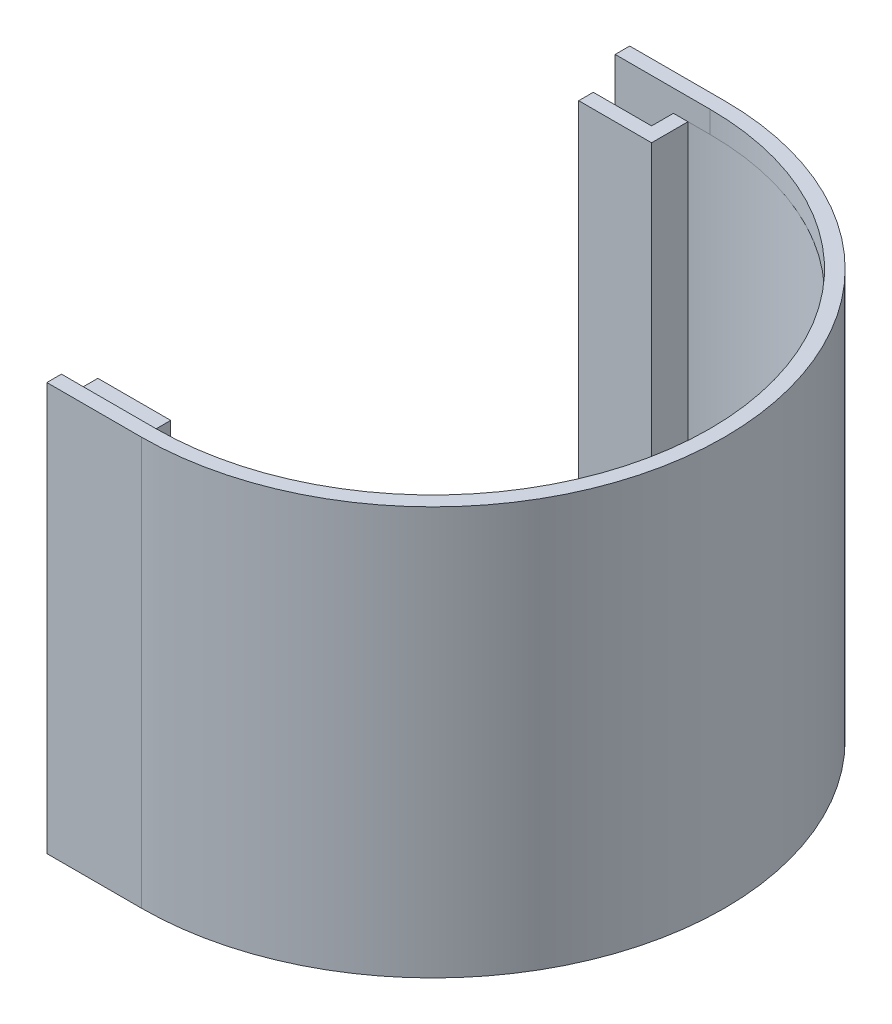
ISO-10303-21;
HEADER;
FILE_DESCRIPTION(('STEP AP214'),'2;1');
FILE_NAME('part.step','',(''),(''),'','','');
FILE_SCHEMA(('AUTOMOTIVE_DESIGN { 1 0 10303 214 1 1 1 1 }'));
ENDSEC;
DATA;
#1=APPLICATION_CONTEXT('core data for automotive mechanical design processes');
#2=APPLICATION_PROTOCOL_DEFINITION('international standard','automotive_design',2000,#1);
#3=PRODUCT_CONTEXT('',#1,'mechanical');
#4=PRODUCT('Part','Part','',(#3));
#5=PRODUCT_RELATED_PRODUCT_CATEGORY('part','',(#4));
#6=PRODUCT_DEFINITION_FORMATION('','',#4);
#7=PRODUCT_DEFINITION_CONTEXT('part definition',#1,'design');
#8=PRODUCT_DEFINITION('design','',#6,#7);
#9=PRODUCT_DEFINITION_SHAPE('','',#8);
#10=(LENGTH_UNIT() NAMED_UNIT(*) SI_UNIT(.MILLI.,.METRE.));
#11=(NAMED_UNIT(*) PLANE_ANGLE_UNIT() SI_UNIT($,.RADIAN.));
#12=(NAMED_UNIT(*) SI_UNIT($,.STERADIAN.) SOLID_ANGLE_UNIT());
#13=UNCERTAINTY_MEASURE_WITH_UNIT(LENGTH_MEASURE(1.E-05),#10,'distance_accuracy_value','');
#14=(GEOMETRIC_REPRESENTATION_CONTEXT(3) GLOBAL_UNCERTAINTY_ASSIGNED_CONTEXT((#13)) GLOBAL_UNIT_ASSIGNED_CONTEXT((#10,
#11,#12)) REPRESENTATION_CONTEXT('',''));
#15=CARTESIAN_POINT('',(0.,0.,0.));
#16=DIRECTION('',(0.,0.,1.));
#17=DIRECTION('',(1.,0.,0.));
#18=AXIS2_PLACEMENT_3D('',#15,#16,#17);
#19=CARTESIAN_POINT('',(0.,0.,0.));
#20=DIRECTION('',(0.,-1.,0.));
#21=DIRECTION('',(0.,0.,-1.));
#22=AXIS2_PLACEMENT_3D('',#19,#20,#21);
#23=PLANE('',#22);
#24=DIRECTION('',(-1.,0.,0.));
#25=VECTOR('',#24,1.);
#26=CARTESIAN_POINT('',(-13.,0.,-38.));
#27=LINE('',#26,#25);
#28=CARTESIAN_POINT('',(-3.,0.,-38.));
#29=VERTEX_POINT('',#28);
#30=CARTESIAN_POINT('',(-5.,0.,-38.));
#31=VERTEX_POINT('',#30);
#32=EDGE_CURVE('E13',#29,#31,#27,.T.);
#33=ORIENTED_EDGE('',*,*,#32,.F.);
#34=DIRECTION('',(0.,0.,-1.));
#35=VECTOR('',#34,1.);
#36=CARTESIAN_POINT('',(-3.,0.,-33.));
#37=LINE('',#36,#35);
#38=CARTESIAN_POINT('',(-3.,0.,-33.));
#39=VERTEX_POINT('',#38);
#40=EDGE_CURVE('E176',#39,#29,#37,.T.);
#41=ORIENTED_EDGE('',*,*,#40,.F.);
#42=DIRECTION('',(1.,0.,0.));
#43=VECTOR('',#42,1.);
#44=CARTESIAN_POINT('',(-13.,0.,-33.));
#45=LINE('',#44,#43);
#46=CARTESIAN_POINT('',(-13.,0.,-33.));
#47=VERTEX_POINT('',#46);
#48=EDGE_CURVE('E174',#47,#39,#45,.T.);
#49=ORIENTED_EDGE('',*,*,#48,.F.);
#50=DIRECTION('',(0.,0.,1.));
#51=VECTOR('',#50,1.);
#52=CARTESIAN_POINT('',(-13.,0.,-35.));
#53=LINE('',#52,#51);
#54=CARTESIAN_POINT('',(-13.,0.,-35.));
#55=VERTEX_POINT('',#54);
#56=EDGE_CURVE('E172',#55,#47,#53,.T.);
#57=ORIENTED_EDGE('',*,*,#56,.F.);
#58=DIRECTION('',(-1.,0.,0.));
#59=VECTOR('',#58,1.);
#60=CARTESIAN_POINT('',(-5.,0.,-35.));
#61=LINE('',#60,#59);
#62=CARTESIAN_POINT('',(-5.,0.,-35.));
#63=VERTEX_POINT('',#62);
#64=EDGE_CURVE('E169',#63,#55,#61,.T.);
#65=ORIENTED_EDGE('',*,*,#64,.F.);
#66=DIRECTION('',(0.,0.,1.));
#67=VECTOR('',#66,1.);
#68=CARTESIAN_POINT('',(-5.,0.,-38.));
#69=LINE('',#68,#67);
#70=EDGE_CURVE('E167',#31,#63,#69,.T.);
#71=ORIENTED_EDGE('',*,*,#70,.F.);
#72=EDGE_LOOP('',(#33,#41,#49,#57,#65,#71));
#73=FACE_BOUND('',#72,.T.);
#74=ADVANCED_FACE('F44',(#73),#23,.T.);
#75=CARTESIAN_POINT('',(0.,50.,0.));
#76=DIRECTION('',(0.,-1.,0.));
#77=DIRECTION('',(0.,0.,-1.));
#78=AXIS2_PLACEMENT_3D('',#75,#76,#77);
#79=PLANE('',#78);
#80=DIRECTION('',(-1.,0.,0.));
#81=VECTOR('',#80,1.);
#82=CARTESIAN_POINT('',(0.,50.,38.));
#83=LINE('',#82,#81);
#84=CARTESIAN_POINT('',(-3.,50.,38.));
#85=VERTEX_POINT('',#84);
#86=CARTESIAN_POINT('',(-5.,50.,38.));
#87=VERTEX_POINT('',#86);
#88=EDGE_CURVE('E244',#85,#87,#83,.T.);
#89=ORIENTED_EDGE('',*,*,#88,.F.);
#90=DIRECTION('',(0.,0.,-1.));
#91=VECTOR('',#90,1.);
#92=CARTESIAN_POINT('',(-3.,50.,33.));
#93=LINE('',#92,#91);
#94=CARTESIAN_POINT('',(-3.,50.,33.));
#95=VERTEX_POINT('',#94);
#96=EDGE_CURVE('E323',#85,#95,#93,.T.);
#97=ORIENTED_EDGE('',*,*,#96,.T.);
#98=DIRECTION('',(-1.,0.,0.));
#99=VECTOR('',#98,1.);
#100=CARTESIAN_POINT('',(-13.,50.,33.));
#101=LINE('',#100,#99);
#102=CARTESIAN_POINT('',(-13.,50.,33.));
#103=VERTEX_POINT('',#102);
#104=EDGE_CURVE('E149',#95,#103,#101,.T.);
#105=ORIENTED_EDGE('',*,*,#104,.T.);
#106=DIRECTION('',(0.,0.,1.));
#107=VECTOR('',#106,1.);
#108=CARTESIAN_POINT('',(-13.,50.,35.));
#109=LINE('',#108,#107);
#110=CARTESIAN_POINT('',(-13.,50.,35.));
#111=VERTEX_POINT('',#110);
#112=EDGE_CURVE('E143',#103,#111,#109,.T.);
#113=ORIENTED_EDGE('',*,*,#112,.T.);
#114=DIRECTION('',(1.,0.,0.));
#115=VECTOR('',#114,1.);
#116=CARTESIAN_POINT('',(-5.,50.,35.));
#117=LINE('',#116,#115);
#118=CARTESIAN_POINT('',(-5.,50.,35.));
#119=VERTEX_POINT('',#118);
#120=EDGE_CURVE('E147',#111,#119,#117,.T.);
#121=ORIENTED_EDGE('',*,*,#120,.T.);
#122=DIRECTION('',(0.,0.,1.));
#123=VECTOR('',#122,1.);
#124=CARTESIAN_POINT('',(-5.,50.,38.));
#125=LINE('',#124,#123);
#126=EDGE_CURVE('E64',#119,#87,#125,.T.);
#127=ORIENTED_EDGE('',*,*,#126,.T.);
#128=EDGE_LOOP('',(#89,#97,#105,#113,#121,#127));
#129=FACE_BOUND('',#128,.T.);
#130=ADVANCED_FACE('F145',(#129),#79,.F.);
#131=DIRECTION('',(1.,0.,0.));
#132=VECTOR('',#131,1.);
#133=CARTESIAN_POINT('',(-13.,50.,-38.));
#134=LINE('',#133,#132);
#135=CARTESIAN_POINT('',(-5.,50.,-38.));
#136=VERTEX_POINT('',#135);
#137=CARTESIAN_POINT('',(-3.,50.,-38.));
#138=VERTEX_POINT('',#137);
#139=EDGE_CURVE('E119',#136,#138,#134,.T.);
#140=ORIENTED_EDGE('',*,*,#139,.F.);
#141=DIRECTION('',(0.,0.,1.));
#142=VECTOR('',#141,1.);
#143=CARTESIAN_POINT('',(-5.,50.,-38.));
#144=LINE('',#143,#142);
#145=CARTESIAN_POINT('',(-5.,50.,-35.));
#146=VERTEX_POINT('',#145);
#147=EDGE_CURVE('E190',#136,#146,#144,.T.);
#148=ORIENTED_EDGE('',*,*,#147,.T.);
#149=DIRECTION('',(-1.,0.,0.));
#150=VECTOR('',#149,1.);
#151=CARTESIAN_POINT('',(-5.,50.,-35.));
#152=LINE('',#151,#150);
#153=CARTESIAN_POINT('',(-13.,50.,-35.));
#154=VERTEX_POINT('',#153);
#155=EDGE_CURVE('E312',#146,#154,#152,.T.);
#156=ORIENTED_EDGE('',*,*,#155,.T.);
#157=DIRECTION('',(0.,0.,1.));
#158=VECTOR('',#157,1.);
#159=CARTESIAN_POINT('',(-13.,50.,-35.));
#160=LINE('',#159,#158);
#161=CARTESIAN_POINT('',(-13.,50.,-33.));
#162=VERTEX_POINT('',#161);
#163=EDGE_CURVE('E314',#154,#162,#160,.T.);
#164=ORIENTED_EDGE('',*,*,#163,.T.);
#165=DIRECTION('',(1.,0.,0.));
#166=VECTOR('',#165,1.);
#167=CARTESIAN_POINT('',(-13.,50.,-33.));
#168=LINE('',#167,#166);
#169=CARTESIAN_POINT('',(-3.,50.,-33.));
#170=VERTEX_POINT('',#169);
#171=EDGE_CURVE('E316',#162,#170,#168,.T.);
#172=ORIENTED_EDGE('',*,*,#171,.T.);
#173=DIRECTION('',(0.,0.,-1.));
#174=VECTOR('',#173,1.);
#175=CARTESIAN_POINT('',(-3.,50.,-33.));
#176=LINE('',#175,#174);
#177=EDGE_CURVE('E318',#170,#138,#176,.T.);
#178=ORIENTED_EDGE('',*,*,#177,.T.);
#179=EDGE_LOOP('',(#140,#148,#156,#164,#172,#178));
#180=FACE_BOUND('',#179,.T.);
#181=ADVANCED_FACE('F431',(#180),#79,.F.);
#182=CARTESIAN_POINT('',(0.,50.,0.));
#183=DIRECTION('',(0.,-1.,0.));
#184=DIRECTION('',(0.,0.,-1.));
#185=AXIS2_PLACEMENT_3D('',#182,#183,#184);
#186=CYLINDRICAL_SURFACE('',#185,40.);
#187=DIRECTION('',(0.,-1.,0.));
#188=VECTOR('',#187,1.);
#189=CARTESIAN_POINT('',(0.,50.,40.));
#190=LINE('',#189,#188);
#191=CARTESIAN_POINT('',(0.,53.,40.));
#192=VERTEX_POINT('',#191);
#193=CARTESIAN_POINT('',(0.,-3.,40.));
#194=VERTEX_POINT('',#193);
#195=EDGE_CURVE('E163',#192,#194,#190,.T.);
#196=ORIENTED_EDGE('',*,*,#195,.T.);
#197=CARTESIAN_POINT('',(0.,-3.,0.));
#198=DIRECTION('',(0.,-1.,0.));
#199=DIRECTION('',(0.,0.,1.));
#200=AXIS2_PLACEMENT_3D('',#197,#198,#199);
#201=CIRCLE('',#200,40.);
#202=CARTESIAN_POINT('',(0.,-3.,-40.));
#203=VERTEX_POINT('',#202);
#204=EDGE_CURVE('E387',#203,#194,#201,.T.);
#205=ORIENTED_EDGE('',*,*,#204,.F.);
#206=DIRECTION('',(0.,-1.,0.));
#207=VECTOR('',#206,1.);
#208=CARTESIAN_POINT('',(0.,50.,-40.));
#209=LINE('',#208,#207);
#210=CARTESIAN_POINT('',(0.,53.,-40.));
#211=VERTEX_POINT('',#210);
#212=EDGE_CURVE('E48',#211,#203,#209,.T.);
#213=ORIENTED_EDGE('',*,*,#212,.F.);
#214=CARTESIAN_POINT('',(0.,53.,0.));
#215=DIRECTION('',(0.,1.,0.));
#216=DIRECTION('',(0.,0.,-1.));
#217=AXIS2_PLACEMENT_3D('',#214,#215,#216);
#218=CIRCLE('',#217,40.);
#219=EDGE_CURVE('E274',#192,#211,#218,.T.);
#220=ORIENTED_EDGE('',*,*,#219,.F.);
#221=EDGE_LOOP('',(#196,#205,#213,#220));
#222=FACE_BOUND('',#221,.T.);
#223=ADVANCED_FACE('F46',(#222),#186,.T.);
#224=CARTESIAN_POINT('',(0.,50.,-40.));
#225=DIRECTION('',(0.,0.,1.));
#226=DIRECTION('',(1.,0.,0.));
#227=AXIS2_PLACEMENT_3D('',#224,#225,#226);
#228=PLANE('',#227);
#229=ORIENTED_EDGE('',*,*,#212,.T.);
#230=DIRECTION('',(1.,0.,0.));
#231=VECTOR('',#230,1.);
#232=CARTESIAN_POINT('',(0.,-3.,-40.));
#233=LINE('',#232,#231);
#234=CARTESIAN_POINT('',(-13.,-3.,-40.));
#235=VERTEX_POINT('',#234);
#236=EDGE_CURVE('E271',#235,#203,#233,.T.);
#237=ORIENTED_EDGE('',*,*,#236,.F.);
#238=DIRECTION('',(0.,-1.,0.));
#239=VECTOR('',#238,1.);
#240=CARTESIAN_POINT('',(-13.,50.,-40.));
#241=LINE('',#240,#239);
#242=CARTESIAN_POINT('',(-13.,53.,-40.));
#243=VERTEX_POINT('',#242);
#244=EDGE_CURVE('E229',#243,#235,#241,.T.);
#245=ORIENTED_EDGE('',*,*,#244,.F.);
#246=DIRECTION('',(-1.,0.,0.));
#247=VECTOR('',#246,1.);
#248=CARTESIAN_POINT('',(0.,53.,-40.));
#249=LINE('',#248,#247);
#250=EDGE_CURVE('E277',#211,#243,#249,.T.);
#251=ORIENTED_EDGE('',*,*,#250,.F.);
#252=EDGE_LOOP('',(#229,#237,#245,#251));
#253=FACE_BOUND('',#252,.T.);
#254=ADVANCED_FACE('F612',(#253),#228,.F.);
#255=CARTESIAN_POINT('',(-13.,50.,-40.));
#256=DIRECTION('',(1.,0.,0.));
#257=DIRECTION('',(0.,0.,-1.));
#258=AXIS2_PLACEMENT_3D('',#255,#256,#257);
#259=PLANE('',#258);
#260=ORIENTED_EDGE('',*,*,#244,.T.);
#261=DIRECTION('',(0.,0.,-1.));
#262=VECTOR('',#261,1.);
#263=CARTESIAN_POINT('',(-13.,-3.,-40.));
#264=LINE('',#263,#262);
#265=CARTESIAN_POINT('',(-13.,-3.,-38.));
#266=VERTEX_POINT('',#265);
#267=EDGE_CURVE('E410',#266,#235,#264,.T.);
#268=ORIENTED_EDGE('',*,*,#267,.F.);
#269=DIRECTION('',(0.,-1.,0.));
#270=VECTOR('',#269,1.);
#271=CARTESIAN_POINT('',(-13.,50.,-38.));
#272=LINE('',#271,#270);
#273=CARTESIAN_POINT('',(-13.,53.,-38.));
#274=VERTEX_POINT('',#273);
#275=EDGE_CURVE('E227',#274,#266,#272,.T.);
#276=ORIENTED_EDGE('',*,*,#275,.F.);
#277=DIRECTION('',(0.,0.,1.));
#278=VECTOR('',#277,1.);
#279=CARTESIAN_POINT('',(-13.,53.,-40.));
#280=LINE('',#279,#278);
#281=EDGE_CURVE('E280',#243,#274,#280,.T.);
#282=ORIENTED_EDGE('',*,*,#281,.F.);
#283=EDGE_LOOP('',(#260,#268,#276,#282));
#284=FACE_BOUND('',#283,.T.);
#285=ADVANCED_FACE('F624',(#284),#259,.F.);
#286=CARTESIAN_POINT('',(-13.,50.,-38.));
#287=DIRECTION('',(0.,0.,-1.));
#288=DIRECTION('',(-1.,0.,0.));
#289=AXIS2_PLACEMENT_3D('',#286,#287,#288);
#290=PLANE('',#289);
#291=ORIENTED_EDGE('',*,*,#275,.T.);
#292=DIRECTION('',(-1.,0.,0.));
#293=VECTOR('',#292,1.);
#294=CARTESIAN_POINT('',(-13.,-3.,-38.));
#295=LINE('',#294,#293);
#296=CARTESIAN_POINT('',(0.,-3.,-38.));
#297=VERTEX_POINT('',#296);
#298=EDGE_CURVE('E407',#297,#266,#295,.T.);
#299=ORIENTED_EDGE('',*,*,#298,.F.);
#300=DIRECTION('',(0.,1.,0.));
#301=VECTOR('',#300,1.);
#302=CARTESIAN_POINT('',(0.,-3.,-38.));
#303=LINE('',#302,#301);
#304=CARTESIAN_POINT('',(0.,0.,-38.));
#305=VERTEX_POINT('',#304);
#306=EDGE_CURVE('E262',#297,#305,#303,.T.);
#307=ORIENTED_EDGE('',*,*,#306,.T.);
#308=EDGE_CURVE('E56',#305,#29,#27,.T.);
#309=ORIENTED_EDGE('',*,*,#308,.T.);
#310=ORIENTED_EDGE('',*,*,#32,.T.);
#311=DIRECTION('',(0.,-1.,0.));
#312=VECTOR('',#311,1.);
#313=CARTESIAN_POINT('',(-5.,50.,-38.));
#314=LINE('',#313,#312);
#315=EDGE_CURVE('E225',#136,#31,#314,.T.);
#316=ORIENTED_EDGE('',*,*,#315,.F.);
#317=ORIENTED_EDGE('',*,*,#139,.T.);
#318=CARTESIAN_POINT('',(0.,50.,-38.));
#319=VERTEX_POINT('',#318);
#320=EDGE_CURVE('E246',#138,#319,#134,.T.);
#321=ORIENTED_EDGE('',*,*,#320,.T.);
#322=DIRECTION('',(0.,-1.,0.));
#323=VECTOR('',#322,1.);
#324=CARTESIAN_POINT('',(0.,53.,-38.));
#325=LINE('',#324,#323);
#326=CARTESIAN_POINT('',(0.,53.,-38.));
#327=VERTEX_POINT('',#326);
#328=EDGE_CURVE('E170',#327,#319,#325,.T.);
#329=ORIENTED_EDGE('',*,*,#328,.F.);
#330=DIRECTION('',(1.,0.,0.));
#331=VECTOR('',#330,1.);
#332=CARTESIAN_POINT('',(-13.,53.,-38.));
#333=LINE('',#332,#331);
#334=EDGE_CURVE('E283',#274,#327,#333,.T.);
#335=ORIENTED_EDGE('',*,*,#334,.F.);
#336=EDGE_LOOP('',(#291,#299,#307,#309,#310,#316,#317,#321,#329,#335));
#337=FACE_BOUND('',#336,.T.);
#338=ADVANCED_FACE('F421',(#337),#290,.F.);
#339=CARTESIAN_POINT('',(-5.,50.,-38.));
#340=DIRECTION('',(1.,0.,0.));
#341=DIRECTION('',(0.,0.,-1.));
#342=AXIS2_PLACEMENT_3D('',#339,#340,#341);
#343=PLANE('',#342);
#344=ORIENTED_EDGE('',*,*,#70,.T.);
#345=DIRECTION('',(0.,-1.,0.));
#346=VECTOR('',#345,1.);
#347=CARTESIAN_POINT('',(-5.,50.,-35.));
#348=LINE('',#347,#346);
#349=EDGE_CURVE('E222',#146,#63,#348,.T.);
#350=ORIENTED_EDGE('',*,*,#349,.F.);
#351=ORIENTED_EDGE('',*,*,#147,.F.);
#352=ORIENTED_EDGE('',*,*,#315,.T.);
#353=EDGE_LOOP('',(#344,#350,#351,#352));
#354=FACE_BOUND('',#353,.T.);
#355=ADVANCED_FACE('F446',(#354),#343,.F.);
#356=CARTESIAN_POINT('',(-5.,50.,-35.));
#357=DIRECTION('',(0.,0.,1.));
#358=DIRECTION('',(1.,0.,0.));
#359=AXIS2_PLACEMENT_3D('',#356,#357,#358);
#360=PLANE('',#359);
#361=ORIENTED_EDGE('',*,*,#64,.T.);
#362=DIRECTION('',(0.,-1.,0.));
#363=VECTOR('',#362,1.);
#364=CARTESIAN_POINT('',(-13.,50.,-35.));
#365=LINE('',#364,#363);
#366=EDGE_CURVE('E219',#154,#55,#365,.T.);
#367=ORIENTED_EDGE('',*,*,#366,.F.);
#368=ORIENTED_EDGE('',*,*,#155,.F.);
#369=ORIENTED_EDGE('',*,*,#349,.T.);
#370=EDGE_LOOP('',(#361,#367,#368,#369));
#371=FACE_BOUND('',#370,.T.);
#372=ADVANCED_FACE('F450',(#371),#360,.F.);
#373=CARTESIAN_POINT('',(-13.,50.,-35.));
#374=DIRECTION('',(1.,0.,0.));
#375=DIRECTION('',(0.,0.,-1.));
#376=AXIS2_PLACEMENT_3D('',#373,#374,#375);
#377=PLANE('',#376);
#378=ORIENTED_EDGE('',*,*,#56,.T.);
#379=DIRECTION('',(0.,-1.,0.));
#380=VECTOR('',#379,1.);
#381=CARTESIAN_POINT('',(-13.,50.,-33.));
#382=LINE('',#381,#380);
#383=EDGE_CURVE('E216',#162,#47,#382,.T.);
#384=ORIENTED_EDGE('',*,*,#383,.F.);
#385=ORIENTED_EDGE('',*,*,#163,.F.);
#386=ORIENTED_EDGE('',*,*,#366,.T.);
#387=EDGE_LOOP('',(#378,#384,#385,#386));
#388=FACE_BOUND('',#387,.T.);
#389=ADVANCED_FACE('F452',(#388),#377,.F.);
#390=CARTESIAN_POINT('',(-13.,50.,-33.));
#391=DIRECTION('',(0.,0.,-1.));
#392=DIRECTION('',(-1.,0.,0.));
#393=AXIS2_PLACEMENT_3D('',#390,#391,#392);
#394=PLANE('',#393);
#395=ORIENTED_EDGE('',*,*,#48,.T.);
#396=DIRECTION('',(0.,-1.,0.));
#397=VECTOR('',#396,1.);
#398=CARTESIAN_POINT('',(-3.,50.,-33.));
#399=LINE('',#398,#397);
#400=EDGE_CURVE('E213',#170,#39,#399,.T.);
#401=ORIENTED_EDGE('',*,*,#400,.F.);
#402=ORIENTED_EDGE('',*,*,#171,.F.);
#403=ORIENTED_EDGE('',*,*,#383,.T.);
#404=EDGE_LOOP('',(#395,#401,#402,#403));
#405=FACE_BOUND('',#404,.T.);
#406=ADVANCED_FACE('F437',(#405),#394,.F.);
#407=CARTESIAN_POINT('',(-3.,50.,-33.));
#408=DIRECTION('',(-1.,0.,0.));
#409=DIRECTION('',(0.,0.,1.));
#410=AXIS2_PLACEMENT_3D('',#407,#408,#409);
#411=PLANE('',#410);
#412=ORIENTED_EDGE('',*,*,#40,.T.);
#413=DIRECTION('',(0.,-1.,0.));
#414=VECTOR('',#413,1.);
#415=CARTESIAN_POINT('',(-3.,50.,-38.));
#416=LINE('',#415,#414);
#417=EDGE_CURVE('E210',#138,#29,#416,.T.);
#418=ORIENTED_EDGE('',*,*,#417,.F.);
#419=ORIENTED_EDGE('',*,*,#177,.F.);
#420=ORIENTED_EDGE('',*,*,#400,.T.);
#421=EDGE_LOOP('',(#412,#418,#419,#420));
#422=FACE_BOUND('',#421,.T.);
#423=ADVANCED_FACE('F429',(#422),#411,.F.);
#424=CARTESIAN_POINT('',(0.,50.,0.));
#425=DIRECTION('',(0.,-1.,0.));
#426=DIRECTION('',(0.,0.,-1.));
#427=AXIS2_PLACEMENT_3D('',#424,#425,#426);
#428=CYLINDRICAL_SURFACE('',#427,38.1182371050918);
#429=CARTESIAN_POINT('',(0.,0.,0.));
#430=DIRECTION('',(0.,-1.,0.));
#431=DIRECTION('',(0.,0.,-1.));
#432=AXIS2_PLACEMENT_3D('',#429,#430,#431);
#433=CIRCLE('',#432,38.1182371050918);
#434=CARTESIAN_POINT('',(-3.,0.,38.));
#435=VERTEX_POINT('',#434);
#436=EDGE_CURVE('E179',#29,#435,#433,.T.);
#437=ORIENTED_EDGE('',*,*,#436,.T.);
#438=DIRECTION('',(0.,-1.,0.));
#439=VECTOR('',#438,1.);
#440=CARTESIAN_POINT('',(-3.,50.,38.));
#441=LINE('',#440,#439);
#442=EDGE_CURVE('E207',#85,#435,#441,.T.);
#443=ORIENTED_EDGE('',*,*,#442,.F.);
#444=CARTESIAN_POINT('',(0.,50.,0.));
#445=DIRECTION('',(0.,-1.,0.));
#446=DIRECTION('',(0.,0.,-1.));
#447=AXIS2_PLACEMENT_3D('',#444,#445,#446);
#448=CIRCLE('',#447,38.1182371050918);
#449=EDGE_CURVE('E320',#138,#85,#448,.T.);
#450=ORIENTED_EDGE('',*,*,#449,.F.);
#451=ORIENTED_EDGE('',*,*,#417,.T.);
#452=EDGE_LOOP('',(#437,#443,#450,#451));
#453=FACE_BOUND('',#452,.T.);
#454=ADVANCED_FACE('F425',(#453),#428,.F.);
#455=CARTESIAN_POINT('',(-3.,50.,33.));
#456=DIRECTION('',(-1.,0.,0.));
#457=DIRECTION('',(0.,0.,1.));
#458=AXIS2_PLACEMENT_3D('',#455,#456,#457);
#459=PLANE('',#458);
#460=DIRECTION('',(0.,0.,-1.));
#461=VECTOR('',#460,1.);
#462=CARTESIAN_POINT('',(-3.,0.,33.));
#463=LINE('',#462,#461);
#464=CARTESIAN_POINT('',(-3.,0.,33.));
#465=VERTEX_POINT('',#464);
#466=EDGE_CURVE('E182',#435,#465,#463,.T.);
#467=ORIENTED_EDGE('',*,*,#466,.T.);
#468=DIRECTION('',(0.,-1.,0.));
#469=VECTOR('',#468,1.);
#470=CARTESIAN_POINT('',(-3.,50.,33.));
#471=LINE('',#470,#469);
#472=EDGE_CURVE('E204',#95,#465,#471,.T.);
#473=ORIENTED_EDGE('',*,*,#472,.F.);
#474=ORIENTED_EDGE('',*,*,#96,.F.);
#475=ORIENTED_EDGE('',*,*,#442,.T.);
#476=EDGE_LOOP('',(#467,#473,#474,#475));
#477=FACE_BOUND('',#476,.T.);
#478=ADVANCED_FACE('F328',(#477),#459,.F.);
#479=CARTESIAN_POINT('',(-13.,50.,33.));
#480=DIRECTION('',(0.,0.,1.));
#481=DIRECTION('',(1.,0.,0.));
#482=AXIS2_PLACEMENT_3D('',#479,#480,#481);
#483=PLANE('',#482);
#484=DIRECTION('',(-1.,0.,0.));
#485=VECTOR('',#484,1.);
#486=CARTESIAN_POINT('',(-13.,0.,33.));
#487=LINE('',#486,#485);
#488=CARTESIAN_POINT('',(-13.,0.,33.));
#489=VERTEX_POINT('',#488);
#490=EDGE_CURVE('E184',#465,#489,#487,.T.);
#491=ORIENTED_EDGE('',*,*,#490,.T.);
#492=DIRECTION('',(0.,-1.,0.));
#493=VECTOR('',#492,1.);
#494=CARTESIAN_POINT('',(-13.,50.,33.));
#495=LINE('',#494,#493);
#496=EDGE_CURVE('E158',#103,#489,#495,.T.);
#497=ORIENTED_EDGE('',*,*,#496,.F.);
#498=ORIENTED_EDGE('',*,*,#104,.F.);
#499=ORIENTED_EDGE('',*,*,#472,.T.);
#500=EDGE_LOOP('',(#491,#497,#498,#499));
#501=FACE_BOUND('',#500,.T.);
#502=ADVANCED_FACE('F331',(#501),#483,.F.);
#503=CARTESIAN_POINT('',(-13.,50.,35.));
#504=DIRECTION('',(1.,0.,0.));
#505=DIRECTION('',(0.,0.,-1.));
#506=AXIS2_PLACEMENT_3D('',#503,#504,#505);
#507=PLANE('',#506);
#508=DIRECTION('',(0.,0.,1.));
#509=VECTOR('',#508,1.);
#510=CARTESIAN_POINT('',(-13.,0.,35.));
#511=LINE('',#510,#509);
#512=CARTESIAN_POINT('',(-13.,0.,35.));
#513=VERTEX_POINT('',#512);
#514=EDGE_CURVE('E157',#489,#513,#511,.T.);
#515=ORIENTED_EDGE('',*,*,#514,.T.);
#516=DIRECTION('',(0.,-1.,0.));
#517=VECTOR('',#516,1.);
#518=CARTESIAN_POINT('',(-13.,50.,35.));
#519=LINE('',#518,#517);
#520=EDGE_CURVE('E154',#111,#513,#519,.T.);
#521=ORIENTED_EDGE('',*,*,#520,.F.);
#522=ORIENTED_EDGE('',*,*,#112,.F.);
#523=ORIENTED_EDGE('',*,*,#496,.T.);
#524=EDGE_LOOP('',(#515,#521,#522,#523));
#525=FACE_BOUND('',#524,.T.);
#526=ADVANCED_FACE('F155',(#525),#507,.F.);
#527=CARTESIAN_POINT('',(-5.,50.,35.));
#528=DIRECTION('',(0.,0.,-1.));
#529=DIRECTION('',(-1.,0.,0.));
#530=AXIS2_PLACEMENT_3D('',#527,#528,#529);
#531=PLANE('',#530);
#532=DIRECTION('',(1.,0.,0.));
#533=VECTOR('',#532,1.);
#534=CARTESIAN_POINT('',(-5.,0.,35.));
#535=LINE('',#534,#533);
#536=CARTESIAN_POINT('',(-5.,0.,35.));
#537=VERTEX_POINT('',#536);
#538=EDGE_CURVE('E103',#513,#537,#535,.T.);
#539=ORIENTED_EDGE('',*,*,#538,.T.);
#540=DIRECTION('',(0.,-1.,0.));
#541=VECTOR('',#540,1.);
#542=CARTESIAN_POINT('',(-5.,50.,35.));
#543=LINE('',#542,#541);
#544=EDGE_CURVE('E159',#119,#537,#543,.T.);
#545=ORIENTED_EDGE('',*,*,#544,.F.);
#546=ORIENTED_EDGE('',*,*,#120,.F.);
#547=ORIENTED_EDGE('',*,*,#520,.T.);
#548=EDGE_LOOP('',(#539,#545,#546,#547));
#549=FACE_BOUND('',#548,.T.);
#550=ADVANCED_FACE('F161',(#549),#531,.F.);
#551=CARTESIAN_POINT('',(-5.,50.,38.));
#552=DIRECTION('',(1.,0.,0.));
#553=DIRECTION('',(0.,0.,-1.));
#554=AXIS2_PLACEMENT_3D('',#551,#552,#553);
#555=PLANE('',#554);
#556=DIRECTION('',(0.,0.,1.));
#557=VECTOR('',#556,1.);
#558=CARTESIAN_POINT('',(-5.,0.,38.));
#559=LINE('',#558,#557);
#560=CARTESIAN_POINT('',(-5.,0.,38.));
#561=VERTEX_POINT('',#560);
#562=EDGE_CURVE('E188',#537,#561,#559,.T.);
#563=ORIENTED_EDGE('',*,*,#562,.T.);
#564=DIRECTION('',(0.,-1.,0.));
#565=VECTOR('',#564,1.);
#566=CARTESIAN_POINT('',(-5.,50.,38.));
#567=LINE('',#566,#565);
#568=EDGE_CURVE('E199',#87,#561,#567,.T.);
#569=ORIENTED_EDGE('',*,*,#568,.F.);
#570=ORIENTED_EDGE('',*,*,#126,.F.);
#571=ORIENTED_EDGE('',*,*,#544,.T.);
#572=EDGE_LOOP('',(#563,#569,#570,#571));
#573=FACE_BOUND('',#572,.T.);
#574=ADVANCED_FACE('F334',(#573),#555,.F.);
#575=CARTESIAN_POINT('',(-13.,50.,38.));
#576=DIRECTION('',(0.,0.,1.));
#577=DIRECTION('',(1.,0.,0.));
#578=AXIS2_PLACEMENT_3D('',#575,#576,#577);
#579=PLANE('',#578);
#580=ORIENTED_EDGE('',*,*,#568,.T.);
#581=DIRECTION('',(1.,0.,0.));
#582=VECTOR('',#581,1.);
#583=CARTESIAN_POINT('',(0.,0.,38.));
#584=LINE('',#583,#582);
#585=EDGE_CURVE('E54',#561,#435,#584,.T.);
#586=ORIENTED_EDGE('',*,*,#585,.T.);
#587=CARTESIAN_POINT('',(0.,0.,38.));
#588=VERTEX_POINT('',#587);
#589=EDGE_CURVE('E413',#435,#588,#584,.T.);
#590=ORIENTED_EDGE('',*,*,#589,.T.);
#591=DIRECTION('',(0.,1.,0.));
#592=VECTOR('',#591,1.);
#593=CARTESIAN_POINT('',(0.,-3.,38.));
#594=LINE('',#593,#592);
#595=CARTESIAN_POINT('',(0.,-3.,38.));
#596=VERTEX_POINT('',#595);
#597=EDGE_CURVE('E255',#596,#588,#594,.T.);
#598=ORIENTED_EDGE('',*,*,#597,.F.);
#599=DIRECTION('',(1.,0.,0.));
#600=VECTOR('',#599,1.);
#601=CARTESIAN_POINT('',(0.,-3.,38.));
#602=LINE('',#601,#600);
#603=CARTESIAN_POINT('',(-13.,-3.,38.));
#604=VERTEX_POINT('',#603);
#605=EDGE_CURVE('E403',#604,#596,#602,.T.);
#606=ORIENTED_EDGE('',*,*,#605,.F.);
#607=DIRECTION('',(0.,-1.,0.));
#608=VECTOR('',#607,1.);
#609=CARTESIAN_POINT('',(-13.,50.,38.));
#610=LINE('',#609,#608);
#611=CARTESIAN_POINT('',(-13.,53.,38.));
#612=VERTEX_POINT('',#611);
#613=EDGE_CURVE('E196',#612,#604,#610,.T.);
#614=ORIENTED_EDGE('',*,*,#613,.F.);
#615=DIRECTION('',(-1.,0.,0.));
#616=VECTOR('',#615,1.);
#617=CARTESIAN_POINT('',(0.,53.,38.));
#618=LINE('',#617,#616);
#619=CARTESIAN_POINT('',(0.,53.,38.));
#620=VERTEX_POINT('',#619);
#621=EDGE_CURVE('E289',#620,#612,#618,.T.);
#622=ORIENTED_EDGE('',*,*,#621,.F.);
#623=DIRECTION('',(0.,-1.,0.));
#624=VECTOR('',#623,1.);
#625=CARTESIAN_POINT('',(0.,53.,38.));
#626=LINE('',#625,#624);
#627=CARTESIAN_POINT('',(0.,50.,38.));
#628=VERTEX_POINT('',#627);
#629=EDGE_CURVE('E296',#620,#628,#626,.T.);
#630=ORIENTED_EDGE('',*,*,#629,.T.);
#631=EDGE_CURVE('E251',#628,#85,#83,.T.);
#632=ORIENTED_EDGE('',*,*,#631,.T.);
#633=ORIENTED_EDGE('',*,*,#88,.T.);
#634=EDGE_LOOP('',(#580,#586,#590,#598,#606,#614,#622,#630,#632,#633));
#635=FACE_BOUND('',#634,.T.);
#636=ADVANCED_FACE('F335',(#635),#579,.F.);
#637=CARTESIAN_POINT('',(-13.,50.,40.));
#638=DIRECTION('',(1.,0.,0.));
#639=DIRECTION('',(0.,0.,-1.));
#640=AXIS2_PLACEMENT_3D('',#637,#638,#639);
#641=PLANE('',#640);
#642=ORIENTED_EDGE('',*,*,#613,.T.);
#643=DIRECTION('',(0.,0.,-1.));
#644=VECTOR('',#643,1.);
#645=CARTESIAN_POINT('',(-13.,-3.,38.));
#646=LINE('',#645,#644);
#647=CARTESIAN_POINT('',(-13.,-3.,40.));
#648=VERTEX_POINT('',#647);
#649=EDGE_CURVE('E395',#648,#604,#646,.T.);
#650=ORIENTED_EDGE('',*,*,#649,.F.);
#651=DIRECTION('',(0.,-1.,0.));
#652=VECTOR('',#651,1.);
#653=CARTESIAN_POINT('',(-13.,50.,40.));
#654=LINE('',#653,#652);
#655=CARTESIAN_POINT('',(-13.,53.,40.));
#656=VERTEX_POINT('',#655);
#657=EDGE_CURVE('E193',#656,#648,#654,.T.);
#658=ORIENTED_EDGE('',*,*,#657,.F.);
#659=DIRECTION('',(0.,0.,1.));
#660=VECTOR('',#659,1.);
#661=CARTESIAN_POINT('',(-13.,53.,38.));
#662=LINE('',#661,#660);
#663=EDGE_CURVE('E292',#612,#656,#662,.T.);
#664=ORIENTED_EDGE('',*,*,#663,.F.);
#665=EDGE_LOOP('',(#642,#650,#658,#664));
#666=FACE_BOUND('',#665,.T.);
#667=ADVANCED_FACE('F476',(#666),#641,.F.);
#668=CARTESIAN_POINT('',(0.,50.,40.));
#669=DIRECTION('',(0.,0.,-1.));
#670=DIRECTION('',(-1.,0.,0.));
#671=AXIS2_PLACEMENT_3D('',#668,#669,#670);
#672=PLANE('',#671);
#673=ORIENTED_EDGE('',*,*,#657,.T.);
#674=DIRECTION('',(-1.,0.,0.));
#675=VECTOR('',#674,1.);
#676=CARTESIAN_POINT('',(-13.,-3.,40.));
#677=LINE('',#676,#675);
#678=EDGE_CURVE('E390',#194,#648,#677,.T.);
#679=ORIENTED_EDGE('',*,*,#678,.F.);
#680=ORIENTED_EDGE('',*,*,#195,.F.);
#681=DIRECTION('',(1.,0.,0.));
#682=VECTOR('',#681,1.);
#683=CARTESIAN_POINT('',(-13.,53.,40.));
#684=LINE('',#683,#682);
#685=EDGE_CURVE('E294',#656,#192,#684,.T.);
#686=ORIENTED_EDGE('',*,*,#685,.F.);
#687=EDGE_LOOP('',(#673,#679,#680,#686));
#688=FACE_BOUND('',#687,.T.);
#689=ADVANCED_FACE('F391',(#688),#672,.F.);
#690=ORIENTED_EDGE('',*,*,#585,.F.);
#691=ORIENTED_EDGE('',*,*,#562,.F.);
#692=ORIENTED_EDGE('',*,*,#538,.F.);
#693=ORIENTED_EDGE('',*,*,#514,.F.);
#694=ORIENTED_EDGE('',*,*,#490,.F.);
#695=ORIENTED_EDGE('',*,*,#466,.F.);
#696=EDGE_LOOP('',(#690,#691,#692,#693,#694,#695));
#697=FACE_BOUND('',#696,.T.);
#698=ADVANCED_FACE('F332',(#697),#23,.T.);
#699=CARTESIAN_POINT('',(0.,53.,0.));
#700=DIRECTION('',(0.,-1.,0.));
#701=DIRECTION('',(0.,0.,-1.));
#702=AXIS2_PLACEMENT_3D('',#699,#700,#701);
#703=CYLINDRICAL_SURFACE('',#702,38.);
#704=CARTESIAN_POINT('',(0.,50.,0.));
#705=DIRECTION('',(0.,-1.,0.));
#706=DIRECTION('',(0.,0.,-1.));
#707=AXIS2_PLACEMENT_3D('',#704,#705,#706);
#708=CIRCLE('',#707,38.);
#709=EDGE_CURVE('E254',#319,#628,#708,.T.);
#710=ORIENTED_EDGE('',*,*,#709,.T.);
#711=ORIENTED_EDGE('',*,*,#629,.F.);
#712=CARTESIAN_POINT('',(0.,53.,0.));
#713=DIRECTION('',(0.,-1.,0.));
#714=DIRECTION('',(0.,0.,-1.));
#715=AXIS2_PLACEMENT_3D('',#712,#713,#714);
#716=CIRCLE('',#715,38.);
#717=EDGE_CURVE('E286',#327,#620,#716,.T.);
#718=ORIENTED_EDGE('',*,*,#717,.F.);
#719=ORIENTED_EDGE('',*,*,#328,.T.);
#720=EDGE_LOOP('',(#710,#711,#718,#719));
#721=FACE_BOUND('',#720,.T.);
#722=ADVANCED_FACE('F469',(#721),#703,.F.);
#723=CARTESIAN_POINT('',(0.,53.,0.));
#724=DIRECTION('',(0.,-1.,0.));
#725=DIRECTION('',(0.,0.,-1.));
#726=AXIS2_PLACEMENT_3D('',#723,#724,#725);
#727=PLANE('',#726);
#728=ORIENTED_EDGE('',*,*,#219,.T.);
#729=ORIENTED_EDGE('',*,*,#250,.T.);
#730=ORIENTED_EDGE('',*,*,#281,.T.);
#731=ORIENTED_EDGE('',*,*,#334,.T.);
#732=ORIENTED_EDGE('',*,*,#717,.T.);
#733=ORIENTED_EDGE('',*,*,#621,.T.);
#734=ORIENTED_EDGE('',*,*,#663,.T.);
#735=ORIENTED_EDGE('',*,*,#685,.T.);
#736=EDGE_LOOP('',(#728,#729,#730,#731,#732,#733,#734,#735));
#737=FACE_BOUND('',#736,.T.);
#738=ADVANCED_FACE('F474',(#737),#727,.F.);
#739=CARTESIAN_POINT('',(0.,50.,0.));
#740=DIRECTION('',(0.,-1.,0.));
#741=DIRECTION('',(0.,0.,-1.));
#742=AXIS2_PLACEMENT_3D('',#739,#740,#741);
#743=PLANE('',#742);
#744=ORIENTED_EDGE('',*,*,#320,.F.);
#745=ORIENTED_EDGE('',*,*,#449,.T.);
#746=ORIENTED_EDGE('',*,*,#631,.F.);
#747=ORIENTED_EDGE('',*,*,#709,.F.);
#748=EDGE_LOOP('',(#744,#745,#746,#747));
#749=FACE_BOUND('',#748,.T.);
#750=ADVANCED_FACE('F340',(#749),#743,.T.);
#751=CARTESIAN_POINT('',(0.,0.,0.));
#752=DIRECTION('',(0.,1.,0.));
#753=DIRECTION('',(0.,0.,1.));
#754=AXIS2_PLACEMENT_3D('',#751,#752,#753);
#755=PLANE('',#754);
#756=ORIENTED_EDGE('',*,*,#436,.F.);
#757=ORIENTED_EDGE('',*,*,#308,.F.);
#758=CARTESIAN_POINT('',(0.,0.,0.));
#759=DIRECTION('',(0.,1.,0.));
#760=DIRECTION('',(0.,0.,1.));
#761=AXIS2_PLACEMENT_3D('',#758,#759,#760);
#762=CIRCLE('',#761,38.);
#763=EDGE_CURVE('E400',#588,#305,#762,.T.);
#764=ORIENTED_EDGE('',*,*,#763,.F.);
#765=ORIENTED_EDGE('',*,*,#589,.F.);
#766=EDGE_LOOP('',(#756,#757,#764,#765));
#767=FACE_BOUND('',#766,.T.);
#768=ADVANCED_FACE('F423',(#767),#755,.T.);
#769=CARTESIAN_POINT('',(0.,-3.,0.));
#770=DIRECTION('',(0.,1.,0.));
#771=DIRECTION('',(0.,0.,1.));
#772=AXIS2_PLACEMENT_3D('',#769,#770,#771);
#773=CYLINDRICAL_SURFACE('',#772,38.);
#774=ORIENTED_EDGE('',*,*,#763,.T.);
#775=ORIENTED_EDGE('',*,*,#306,.F.);
#776=CARTESIAN_POINT('',(0.,-3.,0.));
#777=DIRECTION('',(0.,1.,0.));
#778=DIRECTION('',(0.,0.,1.));
#779=AXIS2_PLACEMENT_3D('',#776,#777,#778);
#780=CIRCLE('',#779,38.);
#781=EDGE_CURVE('E405',#596,#297,#780,.T.);
#782=ORIENTED_EDGE('',*,*,#781,.F.);
#783=ORIENTED_EDGE('',*,*,#597,.T.);
#784=EDGE_LOOP('',(#774,#775,#782,#783));
#785=FACE_BOUND('',#784,.T.);
#786=ADVANCED_FACE('F416',(#785),#773,.F.);
#787=CARTESIAN_POINT('',(0.,-3.,0.));
#788=DIRECTION('',(0.,1.,0.));
#789=DIRECTION('',(0.,0.,1.));
#790=AXIS2_PLACEMENT_3D('',#787,#788,#789);
#791=PLANE('',#790);
#792=ORIENTED_EDGE('',*,*,#204,.T.);
#793=ORIENTED_EDGE('',*,*,#678,.T.);
#794=ORIENTED_EDGE('',*,*,#649,.T.);
#795=ORIENTED_EDGE('',*,*,#605,.T.);
#796=ORIENTED_EDGE('',*,*,#781,.T.);
#797=ORIENTED_EDGE('',*,*,#298,.T.);
#798=ORIENTED_EDGE('',*,*,#267,.T.);
#799=ORIENTED_EDGE('',*,*,#236,.T.);
#800=EDGE_LOOP('',(#792,#793,#794,#795,#796,#797,#798,#799));
#801=FACE_BOUND('',#800,.T.);
#802=ADVANCED_FACE('F397',(#801),#791,.F.);
#803=CLOSED_SHELL('',(#74,#130,#181,#223,#254,#285,#338,#355,#372,#389,#406,#423,#454,#478,#502,
#526,#550,#574,#636,#667,#689,#698,#722,#738,#750,#768,#786,#802));
#804=MANIFOLD_SOLID_BREP('B2',#803);
#805=ADVANCED_BREP_SHAPE_REPRESENTATION('',(#18,#804),#14);
#806=SHAPE_DEFINITION_REPRESENTATION(#9,#805);
ENDSEC;
END-ISO-10303-21;
